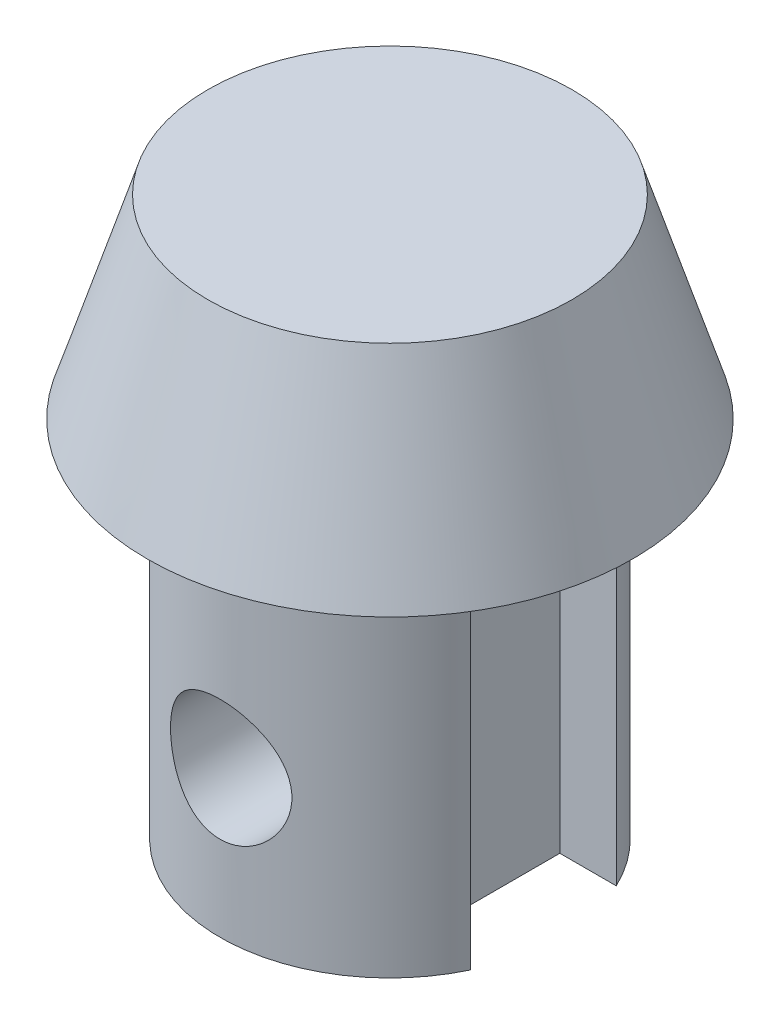
ISO-10303-21;
HEADER;
FILE_DESCRIPTION(('STEP AP214'),'2;1');
FILE_NAME('part.step','',(''),(''),'','','');
FILE_SCHEMA(('AUTOMOTIVE_DESIGN { 1 0 10303 214 1 1 1 1 }'));
ENDSEC;
DATA;
#1=APPLICATION_CONTEXT('core data for automotive mechanical design processes');
#2=APPLICATION_PROTOCOL_DEFINITION('international standard','automotive_design',2000,#1);
#3=PRODUCT_CONTEXT('',#1,'mechanical');
#4=PRODUCT('Part','Part','',(#3));
#5=PRODUCT_RELATED_PRODUCT_CATEGORY('part','',(#4));
#6=PRODUCT_DEFINITION_FORMATION('','',#4);
#7=PRODUCT_DEFINITION_CONTEXT('part definition',#1,'design');
#8=PRODUCT_DEFINITION('design','',#6,#7);
#9=PRODUCT_DEFINITION_SHAPE('','',#8);
#10=(LENGTH_UNIT() NAMED_UNIT(*) SI_UNIT(.MILLI.,.METRE.));
#11=(NAMED_UNIT(*) PLANE_ANGLE_UNIT() SI_UNIT($,.RADIAN.));
#12=(NAMED_UNIT(*) SI_UNIT($,.STERADIAN.) SOLID_ANGLE_UNIT());
#13=UNCERTAINTY_MEASURE_WITH_UNIT(LENGTH_MEASURE(1.E-05),#10,'distance_accuracy_value','');
#14=(GEOMETRIC_REPRESENTATION_CONTEXT(3) GLOBAL_UNCERTAINTY_ASSIGNED_CONTEXT((#13)) GLOBAL_UNIT_ASSIGNED_CONTEXT((#10,
#11,#12)) REPRESENTATION_CONTEXT('',''));
#15=CARTESIAN_POINT('',(0.,0.,0.));
#16=DIRECTION('',(0.,0.,1.));
#17=DIRECTION('',(1.,0.,0.));
#18=AXIS2_PLACEMENT_3D('',#15,#16,#17);
#19=CARTESIAN_POINT('',(0.,15.,0.));
#20=DIRECTION('',(0.,-1.,0.));
#21=DIRECTION('',(0.,0.,-1.));
#22=AXIS2_PLACEMENT_3D('',#19,#20,#21);
#23=CYLINDRICAL_SURFACE('',#22,7.);
#24=CARTESIAN_POINT('',(0.,0.,0.));
#25=DIRECTION('',(0.,1.,0.));
#26=DIRECTION('',(0.,0.,1.));
#27=AXIS2_PLACEMENT_3D('',#24,#25,#26);
#28=CIRCLE('',#27,7.);
#29=CARTESIAN_POINT('',(-6.32455532033676,0.,3.));
#30=VERTEX_POINT('',#29);
#31=CARTESIAN_POINT('',(6.32455532033676,0.,3.));
#32=VERTEX_POINT('',#31);
#33=EDGE_CURVE('E169',#30,#32,#28,.T.);
#34=ORIENTED_EDGE('',*,*,#33,.T.);
#35=DIRECTION('',(0.,-1.,0.));
#36=VECTOR('',#35,1.);
#37=CARTESIAN_POINT('',(6.32455532033676,15.,3.));
#38=LINE('',#37,#36);
#39=CARTESIAN_POINT('',(6.32455532033676,15.,3.));
#40=VERTEX_POINT('',#39);
#41=EDGE_CURVE('E12',#40,#32,#38,.T.);
#42=ORIENTED_EDGE('',*,*,#41,.F.);
#43=CARTESIAN_POINT('',(0.,15.,0.));
#44=DIRECTION('',(0.,1.,0.));
#45=DIRECTION('',(0.,0.,1.));
#46=AXIS2_PLACEMENT_3D('',#43,#44,#45);
#47=CIRCLE('',#46,7.);
#48=CARTESIAN_POINT('',(-6.32455532033676,15.,3.));
#49=VERTEX_POINT('',#48);
#50=EDGE_CURVE('E192',#49,#40,#47,.T.);
#51=ORIENTED_EDGE('',*,*,#50,.F.);
#52=DIRECTION('',(0.,-1.,0.));
#53=VECTOR('',#52,1.);
#54=CARTESIAN_POINT('',(-6.32455532033676,15.,3.));
#55=LINE('',#54,#53);
#56=EDGE_CURVE('E168',#49,#30,#55,.T.);
#57=ORIENTED_EDGE('',*,*,#56,.T.);
#58=EDGE_LOOP('',(#34,#42,#51,#57));
#59=FACE_BOUND('',#58,.T.);
#60=CARTESIAN_POINT('',(-2.5,6.,6.53834841531101));
#61=CARTESIAN_POINT('',(-2.50000293142537,5.86447293759434,6.53834584824662));
#62=CARTESIAN_POINT('',(-2.48894249442902,5.72896613632854,6.54260813914497));
#63=CARTESIAN_POINT('',(-2.44517096849284,5.46200708096645,6.55909115270697));
#64=CARTESIAN_POINT('',(-2.41245881021845,5.33055502746152,6.57131226844033));
#65=CARTESIAN_POINT('',(-2.32671186637106,5.07562524096083,6.60215581723148));
#66=CARTESIAN_POINT('',(-2.27372177606199,4.95213066315779,6.62076416275494));
#67=CARTESIAN_POINT('',(-2.14907922668041,4.71573913120065,6.66226377845014));
#68=CARTESIAN_POINT('',(-2.0774217654137,4.60284502864644,6.68515619613769));
#69=CARTESIAN_POINT('',(-1.91402447589221,4.38577880109018,6.73379932254782));
#70=CARTESIAN_POINT('',(-1.82158324114035,4.28215213793684,6.75962863426194));
#71=CARTESIAN_POINT('',(-1.62073451198083,4.09149315131818,6.81057580348321));
#72=CARTESIAN_POINT('',(-1.51232401016048,4.00446396067198,6.8356935259156));
#73=CARTESIAN_POINT('',(-1.27854087761787,3.84691091314746,6.88331097797524));
#74=CARTESIAN_POINT('',(-1.15275218770255,3.77697050756981,6.90570766813103));
#75=CARTESIAN_POINT('',(-0.890255063415833,3.65946494454605,6.94442306763787));
#76=CARTESIAN_POINT('',(-0.753550054799063,3.61189279953219,6.9607436747499));
#77=CARTESIAN_POINT('',(-0.478828726649301,3.54235905119993,6.98491061598651));
#78=CARTESIAN_POINT('',(-0.341077285205308,3.51946043976448,6.99306609346167));
#79=CARTESIAN_POINT('',(-0.0634617212480514,3.49693161017231,7.00108797904843));
#80=CARTESIAN_POINT('',(0.076401765518947,3.49729452434681,7.0009568336799));
#81=CARTESIAN_POINT('',(0.347592373494542,3.5207111975646,6.99262260766838));
#82=CARTESIAN_POINT('',(0.479020651818556,3.5427445063821,6.98478254135507));
#83=CARTESIAN_POINT('',(0.736174131701907,3.6071728511432,6.96237851891869));
#84=CARTESIAN_POINT('',(0.861898934371374,3.64956930884995,6.94781409330092));
#85=CARTESIAN_POINT('',(1.10616096680958,3.75404691582561,6.91316507785892));
#86=CARTESIAN_POINT('',(1.22457268185839,3.81639576699443,6.89300594264802));
#87=CARTESIAN_POINT('',(1.44953519587014,3.9587791400987,6.84923357904069));
#88=CARTESIAN_POINT('',(1.55608236560633,4.03881905129852,6.82561929883884));
#89=CARTESIAN_POINT('',(1.76033248031897,4.21933077593156,6.77590353640076));
#90=CARTESIAN_POINT('',(1.85725678265592,4.32066690193269,6.74973657984375));
#91=CARTESIAN_POINT('',(2.03301110882291,4.53834348743058,6.69889962393309));
#92=CARTESIAN_POINT('',(2.11183741816384,4.65468701945543,6.67422993264586));
#93=CARTESIAN_POINT('',(2.25045901136819,4.90187765191961,6.62879124339514));
#94=CARTESIAN_POINT('',(2.30987563749326,5.03295306641328,6.6081027649338));
#95=CARTESIAN_POINT('',(2.40551106572703,5.304179451939,6.57389739465231));
#96=CARTESIAN_POINT('',(2.44174134473282,5.44432589505924,6.56037695532893));
#97=CARTESIAN_POINT('',(2.48828716066845,5.72208388576867,6.54286005574888));
#98=CARTESIAN_POINT('',(2.49982704691603,5.859461812678,6.53841416370465));
#99=CARTESIAN_POINT('',(2.50016897842258,6.13423337521672,6.53828418658321));
#100=CARTESIAN_POINT('',(2.48897597969827,6.27162700089379,6.54259819175289));
#101=CARTESIAN_POINT('',(2.44527599545485,6.53657377472731,6.55904904907211));
#102=CARTESIAN_POINT('',(2.41367185988826,6.66429874357693,6.57085417549385));
#103=CARTESIAN_POINT('',(2.33115923950034,6.91258991499362,6.60057618928644));
#104=CARTESIAN_POINT('',(2.2802470270069,7.03315472999922,6.6184942567719));
#105=CARTESIAN_POINT('',(2.15854403482729,7.26840017748808,6.65919897877472));
#106=CARTESIAN_POINT('',(2.08711845508965,7.3827259257826,6.68213439822037));
#107=CARTESIAN_POINT('',(1.92711056207351,7.59820772080303,6.73002297450369));
#108=CARTESIAN_POINT('',(1.83852249165407,7.69935932918255,6.75497680677526));
#109=CARTESIAN_POINT('',(1.64077043500406,7.89154268999623,6.80579566439709));
#110=CARTESIAN_POINT('',(1.53072651663186,7.98167938546273,6.83163247928111));
#111=CARTESIAN_POINT('',(1.29643714363478,8.14229268505071,6.87993729369829));
#112=CARTESIAN_POINT('',(1.1721919264334,8.21276961778492,6.90240534953732));
#113=CARTESIAN_POINT('',(0.913380473926429,8.33150022340817,6.94137984159745));
#114=CARTESIAN_POINT('',(0.778870439322977,8.37986601746067,6.95791626179403));
#115=CARTESIAN_POINT('',(0.502906898921739,8.45304685905716,6.9832833598311));
#116=CARTESIAN_POINT('',(0.361456343526463,8.47787182408849,6.99211728252105));
#117=CARTESIAN_POINT('',(0.0837575092861349,8.50227296664434,7.0008038188261));
#118=CARTESIAN_POINT('',(-0.0523654499558747,8.50312610644893,7.00111065426498));
#119=CARTESIAN_POINT('',(-0.322726803691475,8.48278462301327,6.99386365091442));
#120=CARTESIAN_POINT('',(-0.456965389580551,8.46159225559554,6.98631061639184));
#121=CARTESIAN_POINT('',(-0.716981322330599,8.39863987070442,6.96438311073992));
#122=CARTESIAN_POINT('',(-0.842875555999299,8.35730927663153,6.95015128080456));
#123=CARTESIAN_POINT('',(-1.08597143426168,8.25566690926908,6.91633887698632));
#124=CARTESIAN_POINT('',(-1.20317144494909,8.19535157928641,6.8967573009467));
#125=CARTESIAN_POINT('',(-1.43068233807408,8.05468864767617,6.85325490485467));
#126=CARTESIAN_POINT('',(-1.54052934900394,7.97363552490154,6.82919171160486));
#127=CARTESIAN_POINT('',(-1.74546847276757,7.79494754080834,6.77971046047431));
#128=CARTESIAN_POINT('',(-1.84055552155399,7.69730701241678,6.75429194159098));
#129=CARTESIAN_POINT('',(-2.01782220864538,7.48278117282576,6.70352883842234));
#130=CARTESIAN_POINT('',(-2.09919180205207,7.36521012258063,6.67824313001613));
#131=CARTESIAN_POINT('',(-2.24100798811166,7.11726158568968,6.63200351602705));
#132=CARTESIAN_POINT('',(-2.30145599226941,6.98688496375221,6.61104931825108));
#133=CARTESIAN_POINT('',(-2.39953333207331,6.71625907616111,6.57609213229057));
#134=CARTESIAN_POINT('',(-2.43706721874483,6.57597119362146,6.56211826403834));
#135=CARTESIAN_POINT('',(-2.48729274825372,6.29044610646854,6.54325005921779));
#136=CARTESIAN_POINT('',(-2.4999968591037,6.14521142313578,6.53835116581018));
#137=CARTESIAN_POINT('',(-2.5,6.,6.53834841531101));
#138=B_SPLINE_CURVE_WITH_KNOTS('',3,(#60,#61,#62,#63,#64,#65,#66,#67,#68,#69,#70,#71,#72,#73,
#74,#75,#76,#77,#78,#79,#80,#81,#82,#83,#84,#85,#86,#87,#88,#89,#90,#91,#92,#93,#94,#95,#96,#97,
#98,#99,#100,#101,#102,#103,#104,#105,#106,#107,#108,#109,#110,#111,#112,#113,#114,#115,#116,
#117,#118,#119,#120,#121,#122,#123,#124,#125,#126,#127,#128,#129,#130,#131,#132,#133,#134,#135,
#136,#137),.UNSPECIFIED.,.T.,.F.,(4,2,2,2,2,2,2,2,2,2,2,2,2,2,2,2,2,2,2,2,2,2,2,2,2,2,2,2,2,2,2,
2,2,2,2,2,2,2,4),(0.,0.406041766331002,0.812103587736962,1.21727550243125,1.62255610072681,
2.04441002530116,2.46634349733964,2.90112813694272,3.33577686482073,3.75326460234542,
4.17062908250815,4.56923737347846,4.96787349948484,5.37209971069683,5.77644923231493,
6.20244167773848,6.62852147719004,7.06247609308417,7.4962157414176,7.90789453596191,
8.31948358967586,8.71400941843618,9.10861145427952,9.5170588594572,9.92564351590594,
10.3573204832378,10.7889902346612,11.2184461110406,11.6477209819893,12.0540827015585,
12.4604028439597,12.8584146445103,13.2565010549614,13.67053016118,14.0847010056159,
14.5182116217954,14.9516929848591,15.386967912939,15.8220242160484),.UNSPECIFIED.);
#139=CARTESIAN_POINT('',(-2.5,6.,6.53834841531101));
#140=VERTEX_POINT('',#139);
#141=EDGE_CURVE('E233',#140,#140,#138,.T.);
#142=ORIENTED_EDGE('',*,*,#141,.F.);
#143=EDGE_LOOP('',(#142));
#144=FACE_BOUND('',#143,.T.);
#145=ADVANCED_FACE('F47',(#59,#144),#23,.T.);
#146=CARTESIAN_POINT('',(0.,15.,0.));
#147=DIRECTION('',(0.,-1.,0.));
#148=DIRECTION('',(0.,0.,-1.));
#149=AXIS2_PLACEMENT_3D('',#146,#147,#148);
#150=CYLINDRICAL_SURFACE('',#149,7.);
#151=CARTESIAN_POINT('',(0.,0.,0.));
#152=DIRECTION('',(0.,1.,0.));
#153=DIRECTION('',(0.,0.,1.));
#154=AXIS2_PLACEMENT_3D('',#151,#152,#153);
#155=CIRCLE('',#154,7.);
#156=CARTESIAN_POINT('',(6.32455532033676,0.,-3.));
#157=VERTEX_POINT('',#156);
#158=CARTESIAN_POINT('',(-6.32455532033676,0.,-3.));
#159=VERTEX_POINT('',#158);
#160=EDGE_CURVE('E136',#157,#159,#155,.T.);
#161=ORIENTED_EDGE('',*,*,#160,.T.);
#162=DIRECTION('',(0.,-1.,0.));
#163=VECTOR('',#162,1.);
#164=CARTESIAN_POINT('',(-6.32455532033676,15.,-3.));
#165=LINE('',#164,#163);
#166=CARTESIAN_POINT('',(-6.32455532033676,15.,-3.));
#167=VERTEX_POINT('',#166);
#168=EDGE_CURVE('E127',#167,#159,#165,.T.);
#169=ORIENTED_EDGE('',*,*,#168,.F.);
#170=CARTESIAN_POINT('',(0.,15.,0.));
#171=DIRECTION('',(0.,1.,0.));
#172=DIRECTION('',(0.,0.,1.));
#173=AXIS2_PLACEMENT_3D('',#170,#171,#172);
#174=CIRCLE('',#173,7.);
#175=CARTESIAN_POINT('',(6.32455532033676,15.,-3.));
#176=VERTEX_POINT('',#175);
#177=EDGE_CURVE('E133',#176,#167,#174,.T.);
#178=ORIENTED_EDGE('',*,*,#177,.F.);
#179=DIRECTION('',(0.,-1.,0.));
#180=VECTOR('',#179,1.);
#181=CARTESIAN_POINT('',(6.32455532033676,15.,-3.));
#182=LINE('',#181,#180);
#183=EDGE_CURVE('E140',#176,#157,#182,.T.);
#184=ORIENTED_EDGE('',*,*,#183,.T.);
#185=EDGE_LOOP('',(#161,#169,#178,#184));
#186=FACE_BOUND('',#185,.T.);
#187=CARTESIAN_POINT('',(-2.5,6.,-6.53834841531101));
#188=CARTESIAN_POINT('',(-2.50000293142537,6.13552706240566,-6.53834584824662));
#189=CARTESIAN_POINT('',(-2.48894249442902,6.27103386367146,-6.54260813914497));
#190=CARTESIAN_POINT('',(-2.44517096849284,6.53799291903355,-6.55909115270697));
#191=CARTESIAN_POINT('',(-2.41245881021845,6.66944497253848,-6.57131226844033));
#192=CARTESIAN_POINT('',(-2.32671186637106,6.92437475903917,-6.60215581723148));
#193=CARTESIAN_POINT('',(-2.27372177606199,7.04786933684221,-6.62076416275494));
#194=CARTESIAN_POINT('',(-2.14907922668041,7.28426086879935,-6.66226377845014));
#195=CARTESIAN_POINT('',(-2.0774217654137,7.39715497135356,-6.68515619613769));
#196=CARTESIAN_POINT('',(-1.91402447589221,7.61422119890982,-6.73379932254782));
#197=CARTESIAN_POINT('',(-1.82158324114035,7.71784786206316,-6.75962863426194));
#198=CARTESIAN_POINT('',(-1.62073451198083,7.90850684868182,-6.81057580348321));
#199=CARTESIAN_POINT('',(-1.51232401016048,7.99553603932802,-6.8356935259156));
#200=CARTESIAN_POINT('',(-1.27854087761787,8.15308908685254,-6.88331097797524));
#201=CARTESIAN_POINT('',(-1.15275218770255,8.22302949243018,-6.90570766813103));
#202=CARTESIAN_POINT('',(-0.890255063415833,8.34053505545395,-6.94442306763787));
#203=CARTESIAN_POINT('',(-0.753550054799063,8.38810720046782,-6.9607436747499));
#204=CARTESIAN_POINT('',(-0.478828726649301,8.45764094880007,-6.98491061598651));
#205=CARTESIAN_POINT('',(-0.341077285205308,8.48053956023552,-6.99306609346167));
#206=CARTESIAN_POINT('',(-0.0634617212480513,8.50306838982769,-7.00108797904843));
#207=CARTESIAN_POINT('',(0.0764017655189469,8.50270547565319,-7.0009568336799));
#208=CARTESIAN_POINT('',(0.347592373494542,8.4792888024354,-6.99262260766838));
#209=CARTESIAN_POINT('',(0.479020651818557,8.45725549361789,-6.98478254135507));
#210=CARTESIAN_POINT('',(0.736174131701908,8.3928271488568,-6.96237851891869));
#211=CARTESIAN_POINT('',(0.861898934371374,8.35043069115005,-6.94781409330092));
#212=CARTESIAN_POINT('',(1.10616096680958,8.24595308417439,-6.91316507785892));
#213=CARTESIAN_POINT('',(1.22457268185839,8.18360423300557,-6.89300594264802));
#214=CARTESIAN_POINT('',(1.44953519587014,8.0412208599013,-6.84923357904069));
#215=CARTESIAN_POINT('',(1.55608236560633,7.96118094870148,-6.82561929883884));
#216=CARTESIAN_POINT('',(1.76033248031897,7.78066922406844,-6.77590353640076));
#217=CARTESIAN_POINT('',(1.85725678265592,7.67933309806731,-6.74973657984375));
#218=CARTESIAN_POINT('',(2.03301110882291,7.46165651256942,-6.69889962393309));
#219=CARTESIAN_POINT('',(2.11183741816385,7.34531298054457,-6.67422993264586));
#220=CARTESIAN_POINT('',(2.25045901136819,7.09812234808039,-6.62879124339514));
#221=CARTESIAN_POINT('',(2.30987563749326,6.96704693358672,-6.6081027649338));
#222=CARTESIAN_POINT('',(2.40551106572703,6.695820548061,-6.57389739465231));
#223=CARTESIAN_POINT('',(2.44174134473282,6.55567410494076,-6.56037695532893));
#224=CARTESIAN_POINT('',(2.48828716066845,6.27791611423133,-6.54286005574888));
#225=CARTESIAN_POINT('',(2.49982704691603,6.140538187322,-6.53841416370465));
#226=CARTESIAN_POINT('',(2.50016897842258,5.86576662478328,-6.53828418658321));
#227=CARTESIAN_POINT('',(2.48897597969827,5.72837299910621,-6.54259819175289));
#228=CARTESIAN_POINT('',(2.44527599545485,5.46342622527269,-6.55904904907211));
#229=CARTESIAN_POINT('',(2.41367185988826,5.33570125642307,-6.57085417549385));
#230=CARTESIAN_POINT('',(2.33115923950034,5.08741008500638,-6.60057618928644));
#231=CARTESIAN_POINT('',(2.2802470270069,4.96684527000078,-6.6184942567719));
#232=CARTESIAN_POINT('',(2.15854403482729,4.73159982251192,-6.65919897877472));
#233=CARTESIAN_POINT('',(2.08711845508965,4.6172740742174,-6.68213439822037));
#234=CARTESIAN_POINT('',(1.92711056207351,4.40179227919697,-6.73002297450369));
#235=CARTESIAN_POINT('',(1.83852249165407,4.30064067081745,-6.75497680677526));
#236=CARTESIAN_POINT('',(1.64077043500406,4.10845731000377,-6.80579566439709));
#237=CARTESIAN_POINT('',(1.53072651663186,4.01832061453727,-6.83163247928111));
#238=CARTESIAN_POINT('',(1.29643714363478,3.85770731494929,-6.87993729369829));
#239=CARTESIAN_POINT('',(1.1721919264334,3.78723038221507,-6.90240534953732));
#240=CARTESIAN_POINT('',(0.913380473926428,3.66849977659183,-6.94137984159745));
#241=CARTESIAN_POINT('',(0.778870439322975,3.62013398253933,-6.95791626179403));
#242=CARTESIAN_POINT('',(0.502906898921738,3.54695314094284,-6.9832833598311));
#243=CARTESIAN_POINT('',(0.361456343526463,3.52212817591151,-6.99211728252105));
#244=CARTESIAN_POINT('',(0.0837575092861349,3.49772703335566,-7.0008038188261));
#245=CARTESIAN_POINT('',(-0.0523654499558752,3.49687389355107,-7.00111065426498));
#246=CARTESIAN_POINT('',(-0.322726803691475,3.51721537698673,-6.99386365091442));
#247=CARTESIAN_POINT('',(-0.456965389580551,3.53840774440447,-6.98631061639184));
#248=CARTESIAN_POINT('',(-0.716981322330599,3.60136012929558,-6.96438311073992));
#249=CARTESIAN_POINT('',(-0.842875555999299,3.64269072336847,-6.95015128080456));
#250=CARTESIAN_POINT('',(-1.08597143426168,3.74433309073091,-6.91633887698632));
#251=CARTESIAN_POINT('',(-1.20317144494909,3.80464842071359,-6.8967573009467));
#252=CARTESIAN_POINT('',(-1.43068233807408,3.94531135232383,-6.85325490485467));
#253=CARTESIAN_POINT('',(-1.54052934900394,4.02636447509846,-6.82919171160486));
#254=CARTESIAN_POINT('',(-1.74546847276757,4.20505245919166,-6.77971046047431));
#255=CARTESIAN_POINT('',(-1.84055552155399,4.30269298758322,-6.75429194159098));
#256=CARTESIAN_POINT('',(-2.01782220864538,4.51721882717424,-6.70352883842234));
#257=CARTESIAN_POINT('',(-2.09919180205207,4.63478987741936,-6.67824313001613));
#258=CARTESIAN_POINT('',(-2.24100798811166,4.88273841431031,-6.63200351602705));
#259=CARTESIAN_POINT('',(-2.30145599226941,5.01311503624779,-6.61104931825108));
#260=CARTESIAN_POINT('',(-2.39953333207331,5.28374092383889,-6.57609213229057));
#261=CARTESIAN_POINT('',(-2.43706721874483,5.42402880637854,-6.56211826403834));
#262=CARTESIAN_POINT('',(-2.48729274825372,5.70955389353145,-6.54325005921779));
#263=CARTESIAN_POINT('',(-2.4999968591037,5.85478857686422,-6.53835116581018));
#264=CARTESIAN_POINT('',(-2.5,6.,-6.53834841531101));
#265=B_SPLINE_CURVE_WITH_KNOTS('',3,(#187,#188,#189,#190,#191,#192,#193,#194,#195,#196,#197,
#198,#199,#200,#201,#202,#203,#204,#205,#206,#207,#208,#209,#210,#211,#212,#213,#214,#215,#216,
#217,#218,#219,#220,#221,#222,#223,#224,#225,#226,#227,#228,#229,#230,#231,#232,#233,#234,#235,
#236,#237,#238,#239,#240,#241,#242,#243,#244,#245,#246,#247,#248,#249,#250,#251,#252,#253,#254,
#255,#256,#257,#258,#259,#260,#261,#262,#263,#264),.UNSPECIFIED.,.T.,.F.,(4,2,2,2,2,2,2,2,2,2,2,
2,2,2,2,2,2,2,2,2,2,2,2,2,2,2,2,2,2,2,2,2,2,2,2,2,2,2,4),(0.,0.406041766331002,
0.812103587736962,1.21727550243125,1.62255610072681,2.04441002530116,2.46634349733964,
2.90112813694272,3.33577686482073,3.75326460234542,4.17062908250815,4.56923737347846,
4.96787349948484,5.37209971069683,5.77644923231493,6.20244167773848,6.62852147719004,
7.06247609308417,7.4962157414176,7.90789453596191,8.31948358967586,8.71400941843618,
9.10861145427952,9.5170588594572,9.92564351590595,10.3573204832378,10.7889902346612,
11.2184461110406,11.6477209819893,12.0540827015585,12.4604028439597,12.8584146445103,
13.2565010549614,13.67053016118,14.0847010056159,14.5182116217954,14.9516929848591,
15.386967912939,15.8220242160484),.UNSPECIFIED.);
#266=CARTESIAN_POINT('',(-2.5,6.,-6.53834841531101));
#267=VERTEX_POINT('',#266);
#268=EDGE_CURVE('E51',#267,#267,#265,.T.);
#269=ORIENTED_EDGE('',*,*,#268,.F.);
#270=EDGE_LOOP('',(#269));
#271=FACE_BOUND('',#270,.T.);
#272=ADVANCED_FACE('F129',(#186,#271),#150,.T.);
#273=CARTESIAN_POINT('',(4.,15.,3.));
#274=DIRECTION('',(0.,0.,1.));
#275=DIRECTION('',(1.,0.,0.));
#276=AXIS2_PLACEMENT_3D('',#273,#274,#275);
#277=PLANE('',#276);
#278=DIRECTION('',(-1.,0.,0.));
#279=VECTOR('',#278,1.);
#280=CARTESIAN_POINT('',(4.,0.,3.));
#281=LINE('',#280,#279);
#282=CARTESIAN_POINT('',(4.,0.,3.));
#283=VERTEX_POINT('',#282);
#284=EDGE_CURVE('E173',#32,#283,#281,.T.);
#285=ORIENTED_EDGE('',*,*,#284,.T.);
#286=DIRECTION('',(0.,-1.,0.));
#287=VECTOR('',#286,1.);
#288=CARTESIAN_POINT('',(4.,15.,3.));
#289=LINE('',#288,#287);
#290=CARTESIAN_POINT('',(4.,15.,3.));
#291=VERTEX_POINT('',#290);
#292=EDGE_CURVE('E63',#291,#283,#289,.T.);
#293=ORIENTED_EDGE('',*,*,#292,.F.);
#294=DIRECTION('',(-1.,0.,0.));
#295=VECTOR('',#294,1.);
#296=CARTESIAN_POINT('',(4.,15.,3.));
#297=LINE('',#296,#295);
#298=EDGE_CURVE('E113',#40,#291,#297,.T.);
#299=ORIENTED_EDGE('',*,*,#298,.F.);
#300=ORIENTED_EDGE('',*,*,#41,.T.);
#301=EDGE_LOOP('',(#285,#293,#299,#300));
#302=FACE_BOUND('',#301,.T.);
#303=ADVANCED_FACE('F279',(#302),#277,.F.);
#304=CARTESIAN_POINT('',(4.,15.,3.));
#305=DIRECTION('',(-1.,0.,0.));
#306=DIRECTION('',(0.,0.,1.));
#307=AXIS2_PLACEMENT_3D('',#304,#305,#306);
#308=PLANE('',#307);
#309=DIRECTION('',(0.,0.,-1.));
#310=VECTOR('',#309,1.);
#311=CARTESIAN_POINT('',(4.,0.,3.));
#312=LINE('',#311,#310);
#313=CARTESIAN_POINT('',(4.,0.,-3.));
#314=VERTEX_POINT('',#313);
#315=EDGE_CURVE('E177',#283,#314,#312,.T.);
#316=ORIENTED_EDGE('',*,*,#315,.T.);
#317=DIRECTION('',(0.,-1.,0.));
#318=VECTOR('',#317,1.);
#319=CARTESIAN_POINT('',(4.,15.,-3.));
#320=LINE('',#319,#318);
#321=CARTESIAN_POINT('',(4.,15.,-3.));
#322=VERTEX_POINT('',#321);
#323=EDGE_CURVE('E201',#322,#314,#320,.T.);
#324=ORIENTED_EDGE('',*,*,#323,.F.);
#325=DIRECTION('',(0.,0.,-1.));
#326=VECTOR('',#325,1.);
#327=CARTESIAN_POINT('',(4.,15.,3.));
#328=LINE('',#327,#326);
#329=EDGE_CURVE('E159',#291,#322,#328,.T.);
#330=ORIENTED_EDGE('',*,*,#329,.F.);
#331=ORIENTED_EDGE('',*,*,#292,.T.);
#332=EDGE_LOOP('',(#316,#324,#330,#331));
#333=FACE_BOUND('',#332,.T.);
#334=ADVANCED_FACE('F210',(#333),#308,.F.);
#335=CARTESIAN_POINT('',(4.,15.,-3.));
#336=DIRECTION('',(0.,0.,-1.));
#337=DIRECTION('',(-1.,0.,0.));
#338=AXIS2_PLACEMENT_3D('',#335,#336,#337);
#339=PLANE('',#338);
#340=DIRECTION('',(1.,0.,0.));
#341=VECTOR('',#340,1.);
#342=CARTESIAN_POINT('',(4.,0.,-3.));
#343=LINE('',#342,#341);
#344=EDGE_CURVE('E180',#314,#157,#343,.T.);
#345=ORIENTED_EDGE('',*,*,#344,.T.);
#346=ORIENTED_EDGE('',*,*,#183,.F.);
#347=DIRECTION('',(1.,0.,0.));
#348=VECTOR('',#347,1.);
#349=CARTESIAN_POINT('',(4.,15.,-3.));
#350=LINE('',#349,#348);
#351=EDGE_CURVE('E155',#322,#176,#350,.T.);
#352=ORIENTED_EDGE('',*,*,#351,.F.);
#353=ORIENTED_EDGE('',*,*,#323,.T.);
#354=EDGE_LOOP('',(#345,#346,#352,#353));
#355=FACE_BOUND('',#354,.T.);
#356=ADVANCED_FACE('F216',(#355),#339,.F.);
#357=CARTESIAN_POINT('',(-6.32455532033676,15.,-3.));
#358=DIRECTION('',(0.,0.,-1.));
#359=DIRECTION('',(-1.,0.,0.));
#360=AXIS2_PLACEMENT_3D('',#357,#358,#359);
#361=PLANE('',#360);
#362=DIRECTION('',(1.,0.,0.));
#363=VECTOR('',#362,1.);
#364=CARTESIAN_POINT('',(-6.32455532033676,0.,-3.));
#365=LINE('',#364,#363);
#366=CARTESIAN_POINT('',(-4.,0.,-3.));
#367=VERTEX_POINT('',#366);
#368=EDGE_CURVE('E185',#159,#367,#365,.T.);
#369=ORIENTED_EDGE('',*,*,#368,.T.);
#370=DIRECTION('',(0.,-1.,0.));
#371=VECTOR('',#370,1.);
#372=CARTESIAN_POINT('',(-4.,15.,-3.));
#373=LINE('',#372,#371);
#374=CARTESIAN_POINT('',(-4.,15.,-3.));
#375=VERTEX_POINT('',#374);
#376=EDGE_CURVE('E141',#375,#367,#373,.T.);
#377=ORIENTED_EDGE('',*,*,#376,.F.);
#378=DIRECTION('',(1.,0.,0.));
#379=VECTOR('',#378,1.);
#380=CARTESIAN_POINT('',(-6.32455532033676,15.,-3.));
#381=LINE('',#380,#379);
#382=EDGE_CURVE('E144',#167,#375,#381,.T.);
#383=ORIENTED_EDGE('',*,*,#382,.F.);
#384=ORIENTED_EDGE('',*,*,#168,.T.);
#385=EDGE_LOOP('',(#369,#377,#383,#384));
#386=FACE_BOUND('',#385,.T.);
#387=ADVANCED_FACE('F145',(#386),#361,.F.);
#388=CARTESIAN_POINT('',(-4.,15.,3.));
#389=DIRECTION('',(1.,0.,0.));
#390=DIRECTION('',(0.,0.,-1.));
#391=AXIS2_PLACEMENT_3D('',#388,#389,#390);
#392=PLANE('',#391);
#393=DIRECTION('',(0.,0.,1.));
#394=VECTOR('',#393,1.);
#395=CARTESIAN_POINT('',(-4.,0.,3.));
#396=LINE('',#395,#394);
#397=CARTESIAN_POINT('',(-4.,0.,3.));
#398=VERTEX_POINT('',#397);
#399=EDGE_CURVE('E99',#367,#398,#396,.T.);
#400=ORIENTED_EDGE('',*,*,#399,.T.);
#401=DIRECTION('',(0.,-1.,0.));
#402=VECTOR('',#401,1.);
#403=CARTESIAN_POINT('',(-4.,15.,3.));
#404=LINE('',#403,#402);
#405=CARTESIAN_POINT('',(-4.,15.,3.));
#406=VERTEX_POINT('',#405);
#407=EDGE_CURVE('E71',#406,#398,#404,.T.);
#408=ORIENTED_EDGE('',*,*,#407,.F.);
#409=DIRECTION('',(0.,0.,1.));
#410=VECTOR('',#409,1.);
#411=CARTESIAN_POINT('',(-4.,15.,3.));
#412=LINE('',#411,#410);
#413=EDGE_CURVE('E149',#375,#406,#412,.T.);
#414=ORIENTED_EDGE('',*,*,#413,.F.);
#415=ORIENTED_EDGE('',*,*,#376,.T.);
#416=EDGE_LOOP('',(#400,#408,#414,#415));
#417=FACE_BOUND('',#416,.T.);
#418=ADVANCED_FACE('F306',(#417),#392,.F.);
#419=CARTESIAN_POINT('',(-6.32455532033676,15.,3.));
#420=DIRECTION('',(0.,0.,1.));
#421=DIRECTION('',(1.,0.,0.));
#422=AXIS2_PLACEMENT_3D('',#419,#420,#421);
#423=PLANE('',#422);
#424=DIRECTION('',(-1.,0.,0.));
#425=VECTOR('',#424,1.);
#426=CARTESIAN_POINT('',(-6.32455532033676,0.,3.));
#427=LINE('',#426,#425);
#428=EDGE_CURVE('E105',#398,#30,#427,.T.);
#429=ORIENTED_EDGE('',*,*,#428,.T.);
#430=ORIENTED_EDGE('',*,*,#56,.F.);
#431=DIRECTION('',(-1.,0.,0.));
#432=VECTOR('',#431,1.);
#433=CARTESIAN_POINT('',(-6.32455532033676,15.,3.));
#434=LINE('',#433,#432);
#435=EDGE_CURVE('E165',#406,#49,#434,.T.);
#436=ORIENTED_EDGE('',*,*,#435,.F.);
#437=ORIENTED_EDGE('',*,*,#407,.T.);
#438=EDGE_LOOP('',(#429,#430,#436,#437));
#439=FACE_BOUND('',#438,.T.);
#440=ADVANCED_FACE('F312',(#439),#423,.F.);
#441=CARTESIAN_POINT('',(0.,0.,0.));
#442=DIRECTION('',(0.,1.,0.));
#443=DIRECTION('',(0.,0.,1.));
#444=AXIS2_PLACEMENT_3D('',#441,#442,#443);
#445=PLANE('',#444);
#446=ORIENTED_EDGE('',*,*,#33,.F.);
#447=ORIENTED_EDGE('',*,*,#428,.F.);
#448=ORIENTED_EDGE('',*,*,#399,.F.);
#449=ORIENTED_EDGE('',*,*,#368,.F.);
#450=ORIENTED_EDGE('',*,*,#160,.F.);
#451=ORIENTED_EDGE('',*,*,#344,.F.);
#452=ORIENTED_EDGE('',*,*,#315,.F.);
#453=ORIENTED_EDGE('',*,*,#284,.F.);
#454=EDGE_LOOP('',(#446,#447,#448,#449,#450,#451,#452,#453));
#455=FACE_BOUND('',#454,.T.);
#456=ADVANCED_FACE('F214',(#455),#445,.F.);
#457=CARTESIAN_POINT('',(0.,15.,0.));
#458=DIRECTION('',(0.,1.,0.));
#459=DIRECTION('',(0.,0.,1.));
#460=AXIS2_PLACEMENT_3D('',#457,#458,#459);
#461=PLANE('',#460);
#462=CARTESIAN_POINT('',(0.,15.,0.));
#463=DIRECTION('',(0.,1.,0.));
#464=DIRECTION('',(0.,0.,1.));
#465=AXIS2_PLACEMENT_3D('',#462,#463,#464);
#466=CIRCLE('',#465,10.);
#467=CARTESIAN_POINT('',(0.,15.,10.));
#468=VERTEX_POINT('',#467);
#469=EDGE_CURVE('E174',#468,#468,#466,.T.);
#470=ORIENTED_EDGE('',*,*,#469,.F.);
#471=EDGE_LOOP('',(#470));
#472=FACE_BOUND('',#471,.T.);
#473=ORIENTED_EDGE('',*,*,#435,.T.);
#474=ORIENTED_EDGE('',*,*,#50,.T.);
#475=ORIENTED_EDGE('',*,*,#298,.T.);
#476=ORIENTED_EDGE('',*,*,#329,.T.);
#477=ORIENTED_EDGE('',*,*,#351,.T.);
#478=ORIENTED_EDGE('',*,*,#177,.T.);
#479=ORIENTED_EDGE('',*,*,#382,.T.);
#480=ORIENTED_EDGE('',*,*,#413,.T.);
#481=EDGE_LOOP('',(#473,#474,#475,#476,#477,#478,#479,#480));
#482=FACE_BOUND('',#481,.T.);
#483=ADVANCED_FACE('F152',(#472,#482),#461,.F.);
#484=CARTESIAN_POINT('',(0.,23.,0.));
#485=DIRECTION('',(0.,1.,0.));
#486=DIRECTION('',(0.,0.,1.));
#487=AXIS2_PLACEMENT_3D('',#484,#485,#486);
#488=PLANE('',#487);
#489=CARTESIAN_POINT('',(0.,23.,0.));
#490=DIRECTION('',(0.,1.,0.));
#491=DIRECTION('',(0.,0.,1.));
#492=AXIS2_PLACEMENT_3D('',#489,#490,#491);
#493=CIRCLE('',#492,7.5);
#494=CARTESIAN_POINT('',(0.,23.,7.5));
#495=VERTEX_POINT('',#494);
#496=EDGE_CURVE('E227',#495,#495,#493,.T.);
#497=ORIENTED_EDGE('',*,*,#496,.T.);
#498=EDGE_LOOP('',(#497));
#499=FACE_BOUND('',#498,.T.);
#500=ADVANCED_FACE('F239',(#499),#488,.T.);
#501=CARTESIAN_POINT('',(0.,23.,0.));
#502=DIRECTION('',(0.,-1.,0.));
#503=DIRECTION('',(0.,0.,-1.));
#504=AXIS2_PLACEMENT_3D('',#501,#502,#503);
#505=CONICAL_SURFACE('',#504,7.5,0.302884868374971);
#506=ORIENTED_EDGE('',*,*,#496,.F.);
#507=EDGE_LOOP('',(#506));
#508=FACE_BOUND('',#507,.T.);
#509=ORIENTED_EDGE('',*,*,#469,.T.);
#510=EDGE_LOOP('',(#509));
#511=FACE_BOUND('',#510,.T.);
#512=ADVANCED_FACE('F248',(#508,#511),#505,.T.);
#513=CARTESIAN_POINT('',(0.,6.,-10.));
#514=DIRECTION('',(0.,0.,-1.));
#515=DIRECTION('',(-1.,0.,0.));
#516=AXIS2_PLACEMENT_3D('',#513,#514,#515);
#517=CYLINDRICAL_SURFACE('',#516,2.5);
#518=ORIENTED_EDGE('',*,*,#268,.T.);
#519=EDGE_LOOP('',(#518));
#520=FACE_BOUND('',#519,.T.);
#521=ORIENTED_EDGE('',*,*,#141,.T.);
#522=EDGE_LOOP('',(#521));
#523=FACE_BOUND('',#522,.T.);
#524=ADVANCED_FACE('F250',(#520,#523),#517,.F.);
#525=CLOSED_SHELL('',(#145,#272,#303,#334,#356,#387,#418,#440,#456,#483,#500,#512,#524));
#526=MANIFOLD_SOLID_BREP('B2',#525);
#527=ADVANCED_BREP_SHAPE_REPRESENTATION('',(#18,#526),#14);
#528=SHAPE_DEFINITION_REPRESENTATION(#9,#527);
ENDSEC;
END-ISO-10303-21;
